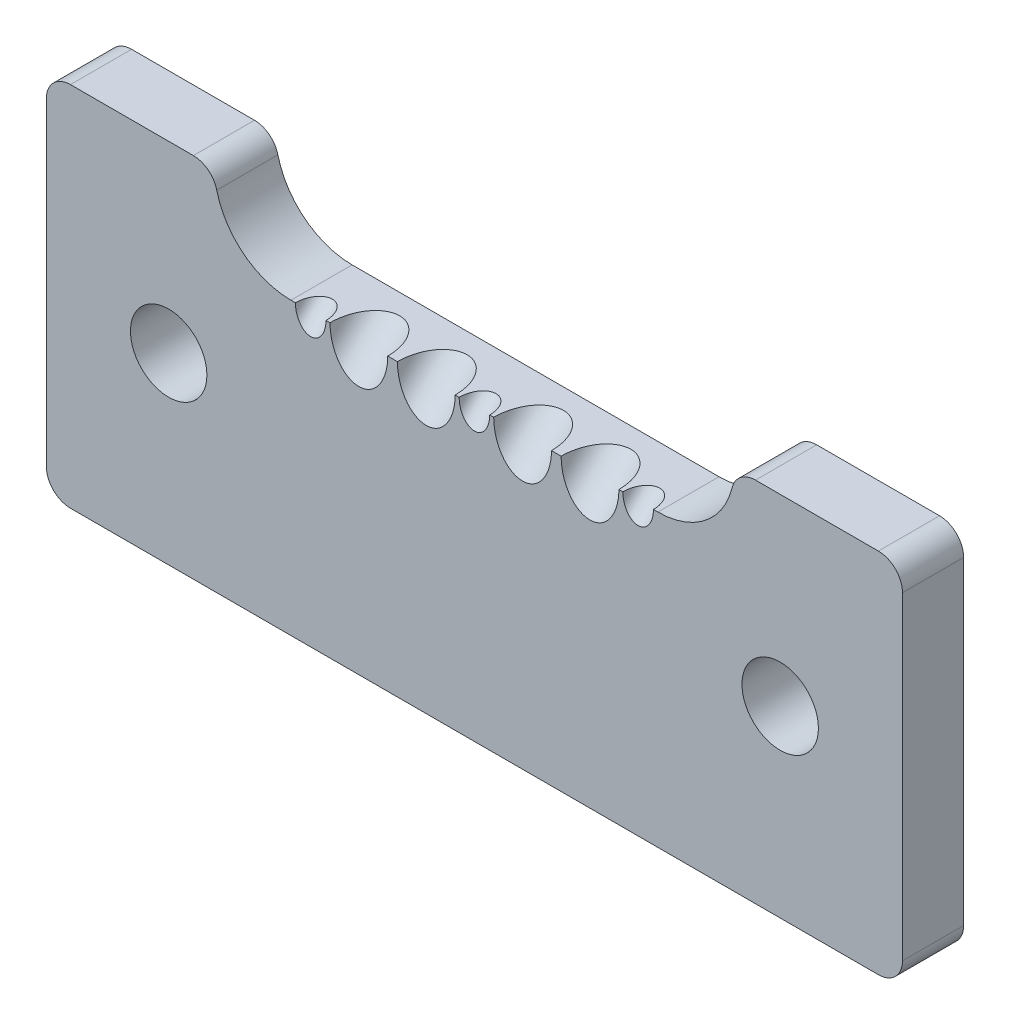
ISO-10303-21;
HEADER;
FILE_DESCRIPTION(('STEP AP214'),'2;1');
FILE_NAME('part.step','',(''),(''),'','','');
FILE_SCHEMA(('AUTOMOTIVE_DESIGN { 1 0 10303 214 1 1 1 1 }'));
ENDSEC;
DATA;
#1=APPLICATION_CONTEXT('core data for automotive mechanical design processes');
#2=APPLICATION_PROTOCOL_DEFINITION('international standard','automotive_design',2000,#1);
#3=PRODUCT_CONTEXT('',#1,'mechanical');
#4=PRODUCT('Part','Part','',(#3));
#5=PRODUCT_RELATED_PRODUCT_CATEGORY('part','',(#4));
#6=PRODUCT_DEFINITION_FORMATION('','',#4);
#7=PRODUCT_DEFINITION_CONTEXT('part definition',#1,'design');
#8=PRODUCT_DEFINITION('design','',#6,#7);
#9=PRODUCT_DEFINITION_SHAPE('','',#8);
#10=(LENGTH_UNIT() NAMED_UNIT(*) SI_UNIT(.MILLI.,.METRE.));
#11=(NAMED_UNIT(*) PLANE_ANGLE_UNIT() SI_UNIT($,.RADIAN.));
#12=(NAMED_UNIT(*) SI_UNIT($,.STERADIAN.) SOLID_ANGLE_UNIT());
#13=UNCERTAINTY_MEASURE_WITH_UNIT(LENGTH_MEASURE(1.E-05),#10,'distance_accuracy_value','');
#14=(GEOMETRIC_REPRESENTATION_CONTEXT(3) GLOBAL_UNCERTAINTY_ASSIGNED_CONTEXT((#13)) GLOBAL_UNIT_ASSIGNED_CONTEXT((#10,
#11,#12)) REPRESENTATION_CONTEXT('',''));
#15=CARTESIAN_POINT('',(0.,0.,0.));
#16=DIRECTION('',(0.,0.,1.));
#17=DIRECTION('',(1.,0.,0.));
#18=AXIS2_PLACEMENT_3D('',#15,#16,#17);
#19=CARTESIAN_POINT('',(25.4,38.1,6.35));
#20=DIRECTION('',(0.,0.,-1.));
#21=DIRECTION('',(-1.,0.,0.));
#22=AXIS2_PLACEMENT_3D('',#19,#20,#21);
#23=CYLINDRICAL_SURFACE('',#22,7.94);
#24=CARTESIAN_POINT('',(25.4,38.1,0.));
#25=DIRECTION('',(0.,0.,1.));
#26=DIRECTION('',(1.,0.,0.));
#27=AXIS2_PLACEMENT_3D('',#24,#25,#26);
#28=CIRCLE('',#27,7.94);
#29=CARTESIAN_POINT('',(17.6910115828153,36.1986590038314,0.));
#30=VERTEX_POINT('',#29);
#31=CARTESIAN_POINT('',(25.4,30.16,0.));
#32=VERTEX_POINT('',#31);
#33=EDGE_CURVE('E224',#30,#32,#28,.T.);
#34=ORIENTED_EDGE('',*,*,#33,.F.);
#35=DIRECTION('',(0.,0.,-1.));
#36=VECTOR('',#35,1.);
#37=CARTESIAN_POINT('',(17.6910115828153,36.1986590038314,6.35));
#38=LINE('',#37,#36);
#39=CARTESIAN_POINT('',(17.6910115828153,36.1986590038314,6.35));
#40=VERTEX_POINT('',#39);
#41=EDGE_CURVE('E188',#40,#30,#38,.T.);
#42=ORIENTED_EDGE('',*,*,#41,.F.);
#43=CARTESIAN_POINT('',(25.4,38.1,6.35));
#44=DIRECTION('',(0.,0.,1.));
#45=DIRECTION('',(1.,0.,0.));
#46=AXIS2_PLACEMENT_3D('',#43,#44,#45);
#47=CIRCLE('',#46,7.94);
#48=CARTESIAN_POINT('',(25.4,30.16,6.35));
#49=VERTEX_POINT('',#48);
#50=EDGE_CURVE('E331',#40,#49,#47,.T.);
#51=ORIENTED_EDGE('',*,*,#50,.T.);
#52=DIRECTION('',(0.,0.,-1.));
#53=VECTOR('',#52,1.);
#54=CARTESIAN_POINT('',(25.4,30.16,6.35));
#55=LINE('',#54,#53);
#56=EDGE_CURVE('E213',#49,#32,#55,.T.);
#57=ORIENTED_EDGE('',*,*,#56,.T.);
#58=EDGE_LOOP('',(#34,#42,#51,#57));
#59=FACE_BOUND('',#58,.T.);
#60=ADVANCED_FACE('F38',(#59),#23,.F.);
#61=CARTESIAN_POINT('',(15.2637482272785,35.6,6.35));
#62=DIRECTION('',(0.,0.,-1.));
#63=DIRECTION('',(-1.,0.,0.));
#64=AXIS2_PLACEMENT_3D('',#61,#62,#63);
#65=CYLINDRICAL_SURFACE('',#64,2.5);
#66=CARTESIAN_POINT('',(15.2637482272785,35.6,0.));
#67=DIRECTION('',(0.,0.,1.));
#68=DIRECTION('',(1.,0.,0.));
#69=AXIS2_PLACEMENT_3D('',#66,#67,#68);
#70=CIRCLE('',#69,2.5);
#71=CARTESIAN_POINT('',(15.2637482272785,38.1,0.));
#72=VERTEX_POINT('',#71);
#73=EDGE_CURVE('E227',#30,#72,#70,.T.);
#74=ORIENTED_EDGE('',*,*,#73,.T.);
#75=DIRECTION('',(0.,0.,-1.));
#76=VECTOR('',#75,1.);
#77=CARTESIAN_POINT('',(15.2637482272785,38.1,6.35));
#78=LINE('',#77,#76);
#79=CARTESIAN_POINT('',(15.2637482272785,38.1,6.35));
#80=VERTEX_POINT('',#79);
#81=EDGE_CURVE('E294',#80,#72,#78,.T.);
#82=ORIENTED_EDGE('',*,*,#81,.F.);
#83=CARTESIAN_POINT('',(15.2637482272785,35.6,6.35));
#84=DIRECTION('',(0.,0.,1.));
#85=DIRECTION('',(1.,0.,0.));
#86=AXIS2_PLACEMENT_3D('',#83,#84,#85);
#87=CIRCLE('',#86,2.5);
#88=EDGE_CURVE('E334',#40,#80,#87,.T.);
#89=ORIENTED_EDGE('',*,*,#88,.F.);
#90=ORIENTED_EDGE('',*,*,#41,.T.);
#91=EDGE_LOOP('',(#74,#82,#89,#90));
#92=FACE_BOUND('',#91,.T.);
#93=ADVANCED_FACE('F395',(#92),#65,.T.);
#94=CARTESIAN_POINT('',(0.,38.1,6.35));
#95=DIRECTION('',(0.,1.,0.));
#96=DIRECTION('',(0.,0.,1.));
#97=AXIS2_PLACEMENT_3D('',#94,#95,#96);
#98=PLANE('',#97);
#99=DIRECTION('',(1.,0.,0.));
#100=VECTOR('',#99,1.);
#101=CARTESIAN_POINT('',(0.,38.1,0.));
#102=LINE('',#101,#100);
#103=CARTESIAN_POINT('',(2.50000000000002,38.1,0.));
#104=VERTEX_POINT('',#103);
#105=EDGE_CURVE('E230',#104,#72,#102,.T.);
#106=ORIENTED_EDGE('',*,*,#105,.F.);
#107=DIRECTION('',(0.,0.,-1.));
#108=VECTOR('',#107,1.);
#109=CARTESIAN_POINT('',(2.50000000000002,38.1,6.35));
#110=LINE('',#109,#108);
#111=CARTESIAN_POINT('',(2.50000000000002,38.1,6.35));
#112=VERTEX_POINT('',#111);
#113=EDGE_CURVE('E292',#112,#104,#110,.T.);
#114=ORIENTED_EDGE('',*,*,#113,.F.);
#115=DIRECTION('',(1.,0.,0.));
#116=VECTOR('',#115,1.);
#117=CARTESIAN_POINT('',(0.,38.1,6.35));
#118=LINE('',#117,#116);
#119=EDGE_CURVE('E336',#112,#80,#118,.T.);
#120=ORIENTED_EDGE('',*,*,#119,.T.);
#121=ORIENTED_EDGE('',*,*,#81,.T.);
#122=EDGE_LOOP('',(#106,#114,#120,#121));
#123=FACE_BOUND('',#122,.T.);
#124=ADVANCED_FACE('F400',(#123),#98,.T.);
#125=CARTESIAN_POINT('',(2.5,35.6,6.35));
#126=DIRECTION('',(0.,0.,-1.));
#127=DIRECTION('',(-1.,0.,0.));
#128=AXIS2_PLACEMENT_3D('',#125,#126,#127);
#129=CYLINDRICAL_SURFACE('',#128,2.5);
#130=CARTESIAN_POINT('',(2.5,35.6,0.));
#131=DIRECTION('',(0.,0.,1.));
#132=DIRECTION('',(1.,0.,0.));
#133=AXIS2_PLACEMENT_3D('',#130,#131,#132);
#134=CIRCLE('',#133,2.5);
#135=CARTESIAN_POINT('',(0.,35.6,0.));
#136=VERTEX_POINT('',#135);
#137=EDGE_CURVE('E233',#104,#136,#134,.T.);
#138=ORIENTED_EDGE('',*,*,#137,.T.);
#139=DIRECTION('',(0.,0.,-1.));
#140=VECTOR('',#139,1.);
#141=CARTESIAN_POINT('',(0.,35.6,6.35));
#142=LINE('',#141,#140);
#143=CARTESIAN_POINT('',(0.,35.6,6.35));
#144=VERTEX_POINT('',#143);
#145=EDGE_CURVE('E290',#144,#136,#142,.T.);
#146=ORIENTED_EDGE('',*,*,#145,.F.);
#147=CARTESIAN_POINT('',(2.5,35.6,6.35));
#148=DIRECTION('',(0.,0.,1.));
#149=DIRECTION('',(1.,0.,0.));
#150=AXIS2_PLACEMENT_3D('',#147,#148,#149);
#151=CIRCLE('',#150,2.5);
#152=EDGE_CURVE('E339',#112,#144,#151,.T.);
#153=ORIENTED_EDGE('',*,*,#152,.F.);
#154=ORIENTED_EDGE('',*,*,#113,.T.);
#155=EDGE_LOOP('',(#138,#146,#153,#154));
#156=FACE_BOUND('',#155,.T.);
#157=ADVANCED_FACE('F460',(#156),#129,.T.);
#158=CARTESIAN_POINT('',(0.,0.,6.35));
#159=DIRECTION('',(-1.,0.,0.));
#160=DIRECTION('',(0.,0.,1.));
#161=AXIS2_PLACEMENT_3D('',#158,#159,#160);
#162=PLANE('',#161);
#163=DIRECTION('',(0.,1.,0.));
#164=VECTOR('',#163,1.);
#165=CARTESIAN_POINT('',(0.,0.,0.));
#166=LINE('',#165,#164);
#167=CARTESIAN_POINT('',(0.,2.50000000000002,0.));
#168=VERTEX_POINT('',#167);
#169=EDGE_CURVE('E236',#168,#136,#166,.T.);
#170=ORIENTED_EDGE('',*,*,#169,.F.);
#171=DIRECTION('',(0.,0.,-1.));
#172=VECTOR('',#171,1.);
#173=CARTESIAN_POINT('',(0.,2.50000000000002,6.35));
#174=LINE('',#173,#172);
#175=CARTESIAN_POINT('',(0.,2.50000000000002,6.35));
#176=VERTEX_POINT('',#175);
#177=EDGE_CURVE('E288',#176,#168,#174,.T.);
#178=ORIENTED_EDGE('',*,*,#177,.F.);
#179=DIRECTION('',(0.,1.,0.));
#180=VECTOR('',#179,1.);
#181=CARTESIAN_POINT('',(0.,0.,6.35));
#182=LINE('',#181,#180);
#183=EDGE_CURVE('E341',#176,#144,#182,.T.);
#184=ORIENTED_EDGE('',*,*,#183,.T.);
#185=ORIENTED_EDGE('',*,*,#145,.T.);
#186=EDGE_LOOP('',(#170,#178,#184,#185));
#187=FACE_BOUND('',#186,.T.);
#188=ADVANCED_FACE('F456',(#187),#162,.T.);
#189=CARTESIAN_POINT('',(2.5,2.5,6.35));
#190=DIRECTION('',(0.,0.,-1.));
#191=DIRECTION('',(-1.,0.,0.));
#192=AXIS2_PLACEMENT_3D('',#189,#190,#191);
#193=CYLINDRICAL_SURFACE('',#192,2.5);
#194=CARTESIAN_POINT('',(2.5,2.5,0.));
#195=DIRECTION('',(0.,0.,1.));
#196=DIRECTION('',(1.,0.,0.));
#197=AXIS2_PLACEMENT_3D('',#194,#195,#196);
#198=CIRCLE('',#197,2.5);
#199=CARTESIAN_POINT('',(2.50000000000002,0.,0.));
#200=VERTEX_POINT('',#199);
#201=EDGE_CURVE('E239',#168,#200,#198,.T.);
#202=ORIENTED_EDGE('',*,*,#201,.T.);
#203=DIRECTION('',(0.,0.,-1.));
#204=VECTOR('',#203,1.);
#205=CARTESIAN_POINT('',(2.50000000000002,0.,6.35));
#206=LINE('',#205,#204);
#207=CARTESIAN_POINT('',(2.50000000000002,0.,6.35));
#208=VERTEX_POINT('',#207);
#209=EDGE_CURVE('E285',#208,#200,#206,.T.);
#210=ORIENTED_EDGE('',*,*,#209,.F.);
#211=CARTESIAN_POINT('',(2.5,2.5,6.35));
#212=DIRECTION('',(0.,0.,1.));
#213=DIRECTION('',(1.,0.,0.));
#214=AXIS2_PLACEMENT_3D('',#211,#212,#213);
#215=CIRCLE('',#214,2.5);
#216=EDGE_CURVE('E344',#176,#208,#215,.T.);
#217=ORIENTED_EDGE('',*,*,#216,.F.);
#218=ORIENTED_EDGE('',*,*,#177,.T.);
#219=EDGE_LOOP('',(#202,#210,#217,#218));
#220=FACE_BOUND('',#219,.T.);
#221=ADVANCED_FACE('F452',(#220),#193,.T.);
#222=CARTESIAN_POINT('',(0.,0.,6.35));
#223=DIRECTION('',(0.,1.,0.));
#224=DIRECTION('',(0.,0.,1.));
#225=AXIS2_PLACEMENT_3D('',#222,#223,#224);
#226=PLANE('',#225);
#227=DIRECTION('',(1.,0.,0.));
#228=VECTOR('',#227,1.);
#229=CARTESIAN_POINT('',(0.,0.,0.));
#230=LINE('',#229,#228);
#231=CARTESIAN_POINT('',(86.4,0.,0.));
#232=VERTEX_POINT('',#231);
#233=EDGE_CURVE('E242',#200,#232,#230,.T.);
#234=ORIENTED_EDGE('',*,*,#233,.T.);
#235=DIRECTION('',(0.,0.,-1.));
#236=VECTOR('',#235,1.);
#237=CARTESIAN_POINT('',(86.4,0.,6.35));
#238=LINE('',#237,#236);
#239=CARTESIAN_POINT('',(86.4,0.,6.35));
#240=VERTEX_POINT('',#239);
#241=EDGE_CURVE('E282',#240,#232,#238,.T.);
#242=ORIENTED_EDGE('',*,*,#241,.F.);
#243=DIRECTION('',(1.,0.,0.));
#244=VECTOR('',#243,1.);
#245=CARTESIAN_POINT('',(0.,0.,6.35));
#246=LINE('',#245,#244);
#247=EDGE_CURVE('E347',#208,#240,#246,.T.);
#248=ORIENTED_EDGE('',*,*,#247,.F.);
#249=ORIENTED_EDGE('',*,*,#209,.T.);
#250=EDGE_LOOP('',(#234,#242,#248,#249));
#251=FACE_BOUND('',#250,.T.);
#252=ADVANCED_FACE('F448',(#251),#226,.F.);
#253=CARTESIAN_POINT('',(86.4,2.5,6.35));
#254=DIRECTION('',(0.,0.,-1.));
#255=DIRECTION('',(-1.,0.,0.));
#256=AXIS2_PLACEMENT_3D('',#253,#254,#255);
#257=CYLINDRICAL_SURFACE('',#256,2.5);
#258=CARTESIAN_POINT('',(86.4,2.5,0.));
#259=DIRECTION('',(0.,0.,1.));
#260=DIRECTION('',(1.,0.,0.));
#261=AXIS2_PLACEMENT_3D('',#258,#259,#260);
#262=CIRCLE('',#261,2.5);
#263=CARTESIAN_POINT('',(88.9,2.5,0.));
#264=VERTEX_POINT('',#263);
#265=EDGE_CURVE('E245',#232,#264,#262,.T.);
#266=ORIENTED_EDGE('',*,*,#265,.T.);
#267=DIRECTION('',(0.,0.,-1.));
#268=VECTOR('',#267,1.);
#269=CARTESIAN_POINT('',(88.9,2.5,6.35));
#270=LINE('',#269,#268);
#271=CARTESIAN_POINT('',(88.9,2.5,6.35));
#272=VERTEX_POINT('',#271);
#273=EDGE_CURVE('E279',#272,#264,#270,.T.);
#274=ORIENTED_EDGE('',*,*,#273,.F.);
#275=CARTESIAN_POINT('',(86.4,2.5,6.35));
#276=DIRECTION('',(0.,0.,1.));
#277=DIRECTION('',(1.,0.,0.));
#278=AXIS2_PLACEMENT_3D('',#275,#276,#277);
#279=CIRCLE('',#278,2.5);
#280=EDGE_CURVE('E350',#240,#272,#279,.T.);
#281=ORIENTED_EDGE('',*,*,#280,.F.);
#282=ORIENTED_EDGE('',*,*,#241,.T.);
#283=EDGE_LOOP('',(#266,#274,#281,#282));
#284=FACE_BOUND('',#283,.T.);
#285=ADVANCED_FACE('F444',(#284),#257,.T.);
#286=CARTESIAN_POINT('',(88.9,0.,6.35));
#287=DIRECTION('',(-1.,0.,0.));
#288=DIRECTION('',(0.,0.,1.));
#289=AXIS2_PLACEMENT_3D('',#286,#287,#288);
#290=PLANE('',#289);
#291=DIRECTION('',(0.,1.,0.));
#292=VECTOR('',#291,1.);
#293=CARTESIAN_POINT('',(88.9,0.,0.));
#294=LINE('',#293,#292);
#295=CARTESIAN_POINT('',(88.9,35.6,0.));
#296=VERTEX_POINT('',#295);
#297=EDGE_CURVE('E248',#264,#296,#294,.T.);
#298=ORIENTED_EDGE('',*,*,#297,.T.);
#299=DIRECTION('',(0.,0.,-1.));
#300=VECTOR('',#299,1.);
#301=CARTESIAN_POINT('',(88.9,35.6,6.35));
#302=LINE('',#301,#300);
#303=CARTESIAN_POINT('',(88.9,35.6,6.35));
#304=VERTEX_POINT('',#303);
#305=EDGE_CURVE('E276',#304,#296,#302,.T.);
#306=ORIENTED_EDGE('',*,*,#305,.F.);
#307=DIRECTION('',(0.,1.,0.));
#308=VECTOR('',#307,1.);
#309=CARTESIAN_POINT('',(88.9,0.,6.35));
#310=LINE('',#309,#308);
#311=EDGE_CURVE('E353',#272,#304,#310,.T.);
#312=ORIENTED_EDGE('',*,*,#311,.F.);
#313=ORIENTED_EDGE('',*,*,#273,.T.);
#314=EDGE_LOOP('',(#298,#306,#312,#313));
#315=FACE_BOUND('',#314,.T.);
#316=ADVANCED_FACE('F440',(#315),#290,.F.);
#317=CARTESIAN_POINT('',(86.4,35.6,6.35));
#318=DIRECTION('',(0.,0.,-1.));
#319=DIRECTION('',(-1.,0.,0.));
#320=AXIS2_PLACEMENT_3D('',#317,#318,#319);
#321=CYLINDRICAL_SURFACE('',#320,2.5);
#322=CARTESIAN_POINT('',(86.4,35.6,0.));
#323=DIRECTION('',(0.,0.,1.));
#324=DIRECTION('',(1.,0.,0.));
#325=AXIS2_PLACEMENT_3D('',#322,#323,#324);
#326=CIRCLE('',#325,2.5);
#327=CARTESIAN_POINT('',(86.4,38.1,0.));
#328=VERTEX_POINT('',#327);
#329=EDGE_CURVE('E251',#296,#328,#326,.T.);
#330=ORIENTED_EDGE('',*,*,#329,.T.);
#331=DIRECTION('',(0.,0.,-1.));
#332=VECTOR('',#331,1.);
#333=CARTESIAN_POINT('',(86.4,38.1,6.35));
#334=LINE('',#333,#332);
#335=CARTESIAN_POINT('',(86.4,38.1,6.35));
#336=VERTEX_POINT('',#335);
#337=EDGE_CURVE('E274',#336,#328,#334,.T.);
#338=ORIENTED_EDGE('',*,*,#337,.F.);
#339=CARTESIAN_POINT('',(86.4,35.6,6.35));
#340=DIRECTION('',(0.,0.,1.));
#341=DIRECTION('',(1.,0.,0.));
#342=AXIS2_PLACEMENT_3D('',#339,#340,#341);
#343=CIRCLE('',#342,2.5);
#344=EDGE_CURVE('E356',#304,#336,#343,.T.);
#345=ORIENTED_EDGE('',*,*,#344,.F.);
#346=ORIENTED_EDGE('',*,*,#305,.T.);
#347=EDGE_LOOP('',(#330,#338,#345,#346));
#348=FACE_BOUND('',#347,.T.);
#349=ADVANCED_FACE('F436',(#348),#321,.T.);
#350=CARTESIAN_POINT('',(0.,38.1,6.35));
#351=DIRECTION('',(0.,1.,0.));
#352=DIRECTION('',(0.,0.,1.));
#353=AXIS2_PLACEMENT_3D('',#350,#351,#352);
#354=PLANE('',#353);
#355=DIRECTION('',(1.,0.,0.));
#356=VECTOR('',#355,1.);
#357=CARTESIAN_POINT('',(0.,38.1,0.));
#358=LINE('',#357,#356);
#359=CARTESIAN_POINT('',(73.6362517727215,38.1,0.));
#360=VERTEX_POINT('',#359);
#361=EDGE_CURVE('E254',#360,#328,#358,.T.);
#362=ORIENTED_EDGE('',*,*,#361,.F.);
#363=DIRECTION('',(0.,0.,-1.));
#364=VECTOR('',#363,1.);
#365=CARTESIAN_POINT('',(73.6362517727215,38.1,6.35));
#366=LINE('',#365,#364);
#367=CARTESIAN_POINT('',(73.6362517727215,38.1,6.35));
#368=VERTEX_POINT('',#367);
#369=EDGE_CURVE('E272',#368,#360,#366,.T.);
#370=ORIENTED_EDGE('',*,*,#369,.F.);
#371=DIRECTION('',(1.,0.,0.));
#372=VECTOR('',#371,1.);
#373=CARTESIAN_POINT('',(0.,38.1,6.35));
#374=LINE('',#373,#372);
#375=EDGE_CURVE('E358',#368,#336,#374,.T.);
#376=ORIENTED_EDGE('',*,*,#375,.T.);
#377=ORIENTED_EDGE('',*,*,#337,.T.);
#378=EDGE_LOOP('',(#362,#370,#376,#377));
#379=FACE_BOUND('',#378,.T.);
#380=ADVANCED_FACE('F432',(#379),#354,.T.);
#381=CARTESIAN_POINT('',(73.6362517727215,35.6,6.35));
#382=DIRECTION('',(0.,0.,-1.));
#383=DIRECTION('',(-1.,0.,0.));
#384=AXIS2_PLACEMENT_3D('',#381,#382,#383);
#385=CYLINDRICAL_SURFACE('',#384,2.5);
#386=CARTESIAN_POINT('',(73.6362517727215,35.6,0.));
#387=DIRECTION('',(0.,0.,1.));
#388=DIRECTION('',(1.,0.,0.));
#389=AXIS2_PLACEMENT_3D('',#386,#387,#388);
#390=CIRCLE('',#389,2.5);
#391=CARTESIAN_POINT('',(71.2089884171848,36.1986590038314,0.));
#392=VERTEX_POINT('',#391);
#393=EDGE_CURVE('E257',#360,#392,#390,.T.);
#394=ORIENTED_EDGE('',*,*,#393,.T.);
#395=DIRECTION('',(0.,0.,-1.));
#396=VECTOR('',#395,1.);
#397=CARTESIAN_POINT('',(71.2089884171848,36.1986590038314,6.35));
#398=LINE('',#397,#396);
#399=CARTESIAN_POINT('',(71.2089884171848,36.1986590038314,6.35));
#400=VERTEX_POINT('',#399);
#401=EDGE_CURVE('E270',#400,#392,#398,.T.);
#402=ORIENTED_EDGE('',*,*,#401,.F.);
#403=CARTESIAN_POINT('',(73.6362517727215,35.6,6.35));
#404=DIRECTION('',(0.,0.,1.));
#405=DIRECTION('',(1.,0.,0.));
#406=AXIS2_PLACEMENT_3D('',#403,#404,#405);
#407=CIRCLE('',#406,2.5);
#408=EDGE_CURVE('E360',#368,#400,#407,.T.);
#409=ORIENTED_EDGE('',*,*,#408,.F.);
#410=ORIENTED_EDGE('',*,*,#369,.T.);
#411=EDGE_LOOP('',(#394,#402,#409,#410));
#412=FACE_BOUND('',#411,.T.);
#413=ADVANCED_FACE('F412',(#412),#385,.T.);
#414=CARTESIAN_POINT('',(63.5,38.1,6.35));
#415=DIRECTION('',(0.,0.,-1.));
#416=DIRECTION('',(-1.,0.,0.));
#417=AXIS2_PLACEMENT_3D('',#414,#415,#416);
#418=CYLINDRICAL_SURFACE('',#417,7.94);
#419=CARTESIAN_POINT('',(63.5,38.1,0.));
#420=DIRECTION('',(0.,0.,1.));
#421=DIRECTION('',(1.,0.,0.));
#422=AXIS2_PLACEMENT_3D('',#419,#420,#421);
#423=CIRCLE('',#422,7.94);
#424=CARTESIAN_POINT('',(63.5,30.16,0.));
#425=VERTEX_POINT('',#424);
#426=EDGE_CURVE('E260',#425,#392,#423,.T.);
#427=ORIENTED_EDGE('',*,*,#426,.F.);
#428=DIRECTION('',(0.,0.,-1.));
#429=VECTOR('',#428,1.);
#430=CARTESIAN_POINT('',(63.5,30.16,6.35));
#431=LINE('',#430,#429);
#432=CARTESIAN_POINT('',(63.5,30.16,6.35));
#433=VERTEX_POINT('',#432);
#434=EDGE_CURVE('E268',#433,#425,#431,.T.);
#435=ORIENTED_EDGE('',*,*,#434,.F.);
#436=CARTESIAN_POINT('',(63.5,38.1,6.35));
#437=DIRECTION('',(0.,0.,1.));
#438=DIRECTION('',(1.,0.,0.));
#439=AXIS2_PLACEMENT_3D('',#436,#437,#438);
#440=CIRCLE('',#439,7.94);
#441=EDGE_CURVE('E215',#433,#400,#440,.T.);
#442=ORIENTED_EDGE('',*,*,#441,.T.);
#443=ORIENTED_EDGE('',*,*,#401,.T.);
#444=EDGE_LOOP('',(#427,#435,#442,#443));
#445=FACE_BOUND('',#444,.T.);
#446=ADVANCED_FACE('F371',(#445),#418,.F.);
#447=CARTESIAN_POINT('',(76.2,19.05,6.35));
#448=DIRECTION('',(0.,0.,-1.));
#449=DIRECTION('',(-1.,0.,0.));
#450=AXIS2_PLACEMENT_3D('',#447,#448,#449);
#451=CYLINDRICAL_SURFACE('',#450,3.96874999999999);
#452=CARTESIAN_POINT('',(76.2,19.05,6.35));
#453=DIRECTION('',(0.,0.,1.));
#454=DIRECTION('',(1.,0.,0.));
#455=AXIS2_PLACEMENT_3D('',#452,#453,#454);
#456=CIRCLE('',#455,3.96874999999999);
#457=CARTESIAN_POINT('',(80.16875,19.05,6.35));
#458=VERTEX_POINT('',#457);
#459=EDGE_CURVE('E328',#458,#458,#456,.T.);
#460=ORIENTED_EDGE('',*,*,#459,.T.);
#461=EDGE_LOOP('',(#460));
#462=FACE_BOUND('',#461,.T.);
#463=CARTESIAN_POINT('',(76.2,19.05,0.));
#464=DIRECTION('',(0.,0.,1.));
#465=DIRECTION('',(1.,0.,0.));
#466=AXIS2_PLACEMENT_3D('',#463,#464,#465);
#467=CIRCLE('',#466,3.96874999999999);
#468=CARTESIAN_POINT('',(80.16875,19.05,0.));
#469=VERTEX_POINT('',#468);
#470=EDGE_CURVE('E220',#469,#469,#467,.T.);
#471=ORIENTED_EDGE('',*,*,#470,.F.);
#472=EDGE_LOOP('',(#471));
#473=FACE_BOUND('',#472,.T.);
#474=ADVANCED_FACE('F404',(#462,#473),#451,.F.);
#475=CARTESIAN_POINT('',(12.7,19.05,6.35));
#476=DIRECTION('',(0.,0.,-1.));
#477=DIRECTION('',(-1.,0.,0.));
#478=AXIS2_PLACEMENT_3D('',#475,#476,#477);
#479=CYLINDRICAL_SURFACE('',#478,3.96875);
#480=CARTESIAN_POINT('',(12.7,19.05,6.35));
#481=DIRECTION('',(0.,0.,1.));
#482=DIRECTION('',(1.,0.,0.));
#483=AXIS2_PLACEMENT_3D('',#480,#481,#482);
#484=CIRCLE('',#483,3.96875);
#485=CARTESIAN_POINT('',(16.66875,19.05,6.35));
#486=VERTEX_POINT('',#485);
#487=EDGE_CURVE('E266',#486,#486,#484,.T.);
#488=ORIENTED_EDGE('',*,*,#487,.T.);
#489=EDGE_LOOP('',(#488));
#490=FACE_BOUND('',#489,.T.);
#491=CARTESIAN_POINT('',(12.7,19.05,0.));
#492=DIRECTION('',(0.,0.,1.));
#493=DIRECTION('',(1.,0.,0.));
#494=AXIS2_PLACEMENT_3D('',#491,#492,#493);
#495=CIRCLE('',#494,3.96875);
#496=CARTESIAN_POINT('',(16.66875,19.05,0.));
#497=VERTEX_POINT('',#496);
#498=EDGE_CURVE('E217',#497,#497,#495,.T.);
#499=ORIENTED_EDGE('',*,*,#498,.F.);
#500=EDGE_LOOP('',(#499));
#501=FACE_BOUND('',#500,.T.);
#502=ADVANCED_FACE('F40',(#490,#501),#479,.F.);
#503=CARTESIAN_POINT('',(0.,30.16,6.35));
#504=DIRECTION('',(0.,1.,0.));
#505=DIRECTION('',(0.,0.,1.));
#506=AXIS2_PLACEMENT_3D('',#503,#504,#505);
#507=PLANE('',#506);
#508=CARTESIAN_POINT('',(39.45,30.16,6.35000000000001));
#509=DIRECTION('',(0.,1.,0.));
#510=DIRECTION('',(0.,0.,1.));
#511=AXIS2_PLACEMENT_3D('',#508,#509,#510);
#512=ELLIPSE('',#511,4.24264068711929,3.);
#513=CARTESIAN_POINT('',(42.45,30.16,6.35));
#514=VERTEX_POINT('',#513);
#515=CARTESIAN_POINT('',(36.45,30.16,6.35));
#516=VERTEX_POINT('',#515);
#517=EDGE_CURVE('E221',#514,#516,#512,.T.);
#518=ORIENTED_EDGE('',*,*,#517,.F.);
#519=DIRECTION('',(1.,0.,0.));
#520=VECTOR('',#519,1.);
#521=CARTESIAN_POINT('',(0.,30.16,6.35));
#522=LINE('',#521,#520);
#523=CARTESIAN_POINT('',(42.8625,30.16,6.35));
#524=VERTEX_POINT('',#523);
#525=EDGE_CURVE('E206',#514,#524,#522,.T.);
#526=ORIENTED_EDGE('',*,*,#525,.T.);
#527=CARTESIAN_POINT('',(44.45,30.16,6.35000000000001));
#528=DIRECTION('',(0.,1.,0.));
#529=DIRECTION('',(0.,0.,1.));
#530=AXIS2_PLACEMENT_3D('',#527,#528,#529);
#531=ELLIPSE('',#530,2.24506403026729,1.5875);
#532=CARTESIAN_POINT('',(46.0375,30.16,6.35));
#533=VERTEX_POINT('',#532);
#534=EDGE_CURVE('E197',#533,#524,#531,.T.);
#535=ORIENTED_EDGE('',*,*,#534,.F.);
#536=CARTESIAN_POINT('',(46.45,30.16,6.35));
#537=VERTEX_POINT('',#536);
#538=EDGE_CURVE('E196',#533,#537,#522,.T.);
#539=ORIENTED_EDGE('',*,*,#538,.T.);
#540=CARTESIAN_POINT('',(49.45,30.16,6.35000000000001));
#541=DIRECTION('',(0.,1.,0.));
#542=DIRECTION('',(0.,0.,1.));
#543=AXIS2_PLACEMENT_3D('',#540,#541,#542);
#544=ELLIPSE('',#543,4.24264068711929,3.);
#545=CARTESIAN_POINT('',(52.45,30.16,6.35));
#546=VERTEX_POINT('',#545);
#547=EDGE_CURVE('E182',#546,#537,#544,.T.);
#548=ORIENTED_EDGE('',*,*,#547,.F.);
#549=CARTESIAN_POINT('',(53.45,30.16,6.35));
#550=VERTEX_POINT('',#549);
#551=EDGE_CURVE('E194',#546,#550,#522,.T.);
#552=ORIENTED_EDGE('',*,*,#551,.T.);
#553=CARTESIAN_POINT('',(56.45,30.16,6.35000000000001));
#554=DIRECTION('',(0.,1.,0.));
#555=DIRECTION('',(0.,0.,1.));
#556=AXIS2_PLACEMENT_3D('',#553,#554,#555);
#557=ELLIPSE('',#556,4.24264068711929,3.);
#558=CARTESIAN_POINT('',(59.45,30.16,6.35));
#559=VERTEX_POINT('',#558);
#560=EDGE_CURVE('E59',#559,#550,#557,.T.);
#561=ORIENTED_EDGE('',*,*,#560,.F.);
#562=CARTESIAN_POINT('',(59.8625,30.16,6.35));
#563=VERTEX_POINT('',#562);
#564=EDGE_CURVE('E204',#559,#563,#522,.T.);
#565=ORIENTED_EDGE('',*,*,#564,.T.);
#566=CARTESIAN_POINT('',(61.45,30.16,6.35000000000001));
#567=DIRECTION('',(0.,1.,0.));
#568=DIRECTION('',(0.,0.,1.));
#569=AXIS2_PLACEMENT_3D('',#566,#567,#568);
#570=ELLIPSE('',#569,2.24506403026728,1.58749999999999);
#571=CARTESIAN_POINT('',(63.0375,30.16,6.35));
#572=VERTEX_POINT('',#571);
#573=EDGE_CURVE('E52',#572,#563,#570,.T.);
#574=ORIENTED_EDGE('',*,*,#573,.F.);
#575=EDGE_CURVE('E208',#572,#433,#522,.T.);
#576=ORIENTED_EDGE('',*,*,#575,.T.);
#577=ORIENTED_EDGE('',*,*,#434,.T.);
#578=DIRECTION('',(1.,0.,0.));
#579=VECTOR('',#578,1.);
#580=CARTESIAN_POINT('',(0.,30.16,0.));
#581=LINE('',#580,#579);
#582=EDGE_CURVE('E263',#32,#425,#581,.T.);
#583=ORIENTED_EDGE('',*,*,#582,.F.);
#584=ORIENTED_EDGE('',*,*,#56,.F.);
#585=CARTESIAN_POINT('',(25.8625,30.16,6.35));
#586=VERTEX_POINT('',#585);
#587=EDGE_CURVE('E209',#49,#586,#522,.T.);
#588=ORIENTED_EDGE('',*,*,#587,.T.);
#589=CARTESIAN_POINT('',(27.45,30.16,6.35000000000001));
#590=DIRECTION('',(0.,1.,0.));
#591=DIRECTION('',(0.,0.,1.));
#592=AXIS2_PLACEMENT_3D('',#589,#590,#591);
#593=ELLIPSE('',#592,2.24506403026729,1.5875);
#594=CARTESIAN_POINT('',(29.0375,30.16,6.35));
#595=VERTEX_POINT('',#594);
#596=EDGE_CURVE('E319',#595,#586,#593,.T.);
#597=ORIENTED_EDGE('',*,*,#596,.F.);
#598=CARTESIAN_POINT('',(29.45,30.16,6.35));
#599=VERTEX_POINT('',#598);
#600=EDGE_CURVE('E214',#595,#599,#522,.T.);
#601=ORIENTED_EDGE('',*,*,#600,.T.);
#602=CARTESIAN_POINT('',(32.45,30.16,6.35000000000001));
#603=DIRECTION('',(0.,1.,0.));
#604=DIRECTION('',(0.,0.,1.));
#605=AXIS2_PLACEMENT_3D('',#602,#603,#604);
#606=ELLIPSE('',#605,4.24264068711929,3.);
#607=CARTESIAN_POINT('',(35.45,30.16,6.35));
#608=VERTEX_POINT('',#607);
#609=EDGE_CURVE('E306',#608,#599,#606,.T.);
#610=ORIENTED_EDGE('',*,*,#609,.F.);
#611=EDGE_CURVE('E311',#608,#516,#522,.T.);
#612=ORIENTED_EDGE('',*,*,#611,.T.);
#613=EDGE_LOOP('',(#518,#526,#535,#539,#548,#552,#561,#565,#574,#576,#577,#583,#584,#588,#597,
#601,#610,#612));
#614=FACE_BOUND('',#613,.T.);
#615=ADVANCED_FACE('F193',(#614),#507,.T.);
#616=CARTESIAN_POINT('',(0.,0.,6.35));
#617=DIRECTION('',(0.,0.,1.));
#618=DIRECTION('',(1.,0.,0.));
#619=AXIS2_PLACEMENT_3D('',#616,#617,#618);
#620=PLANE('',#619);
#621=CARTESIAN_POINT('',(39.45,30.16,6.35));
#622=DIRECTION('',(0.,0.,1.));
#623=DIRECTION('',(0.,-1.,0.));
#624=AXIS2_PLACEMENT_3D('',#621,#622,#623);
#625=ELLIPSE('',#624,4.24264068711929,3.);
#626=EDGE_CURVE('E11',#516,#514,#625,.T.);
#627=ORIENTED_EDGE('',*,*,#626,.F.);
#628=ORIENTED_EDGE('',*,*,#611,.F.);
#629=CARTESIAN_POINT('',(32.45,30.16,6.35));
#630=DIRECTION('',(0.,0.,1.));
#631=DIRECTION('',(0.,-1.,0.));
#632=AXIS2_PLACEMENT_3D('',#629,#630,#631);
#633=ELLIPSE('',#632,4.24264068711929,3.);
#634=EDGE_CURVE('E46',#599,#608,#633,.T.);
#635=ORIENTED_EDGE('',*,*,#634,.F.);
#636=ORIENTED_EDGE('',*,*,#600,.F.);
#637=CARTESIAN_POINT('',(27.45,30.16,6.35));
#638=DIRECTION('',(0.,0.,1.));
#639=DIRECTION('',(0.,-1.,0.));
#640=AXIS2_PLACEMENT_3D('',#637,#638,#639);
#641=ELLIPSE('',#640,2.24506403026729,1.5875);
#642=EDGE_CURVE('E298',#586,#595,#641,.T.);
#643=ORIENTED_EDGE('',*,*,#642,.F.);
#644=ORIENTED_EDGE('',*,*,#587,.F.);
#645=ORIENTED_EDGE('',*,*,#50,.F.);
#646=ORIENTED_EDGE('',*,*,#88,.T.);
#647=ORIENTED_EDGE('',*,*,#119,.F.);
#648=ORIENTED_EDGE('',*,*,#152,.T.);
#649=ORIENTED_EDGE('',*,*,#183,.F.);
#650=ORIENTED_EDGE('',*,*,#216,.T.);
#651=ORIENTED_EDGE('',*,*,#247,.T.);
#652=ORIENTED_EDGE('',*,*,#280,.T.);
#653=ORIENTED_EDGE('',*,*,#311,.T.);
#654=ORIENTED_EDGE('',*,*,#344,.T.);
#655=ORIENTED_EDGE('',*,*,#375,.F.);
#656=ORIENTED_EDGE('',*,*,#408,.T.);
#657=ORIENTED_EDGE('',*,*,#441,.F.);
#658=ORIENTED_EDGE('',*,*,#575,.F.);
#659=CARTESIAN_POINT('',(61.45,30.16,6.35));
#660=DIRECTION('',(0.,0.,1.));
#661=DIRECTION('',(0.,-1.,0.));
#662=AXIS2_PLACEMENT_3D('',#659,#660,#661);
#663=ELLIPSE('',#662,2.24506403026728,1.58749999999999);
#664=EDGE_CURVE('E300',#563,#572,#663,.T.);
#665=ORIENTED_EDGE('',*,*,#664,.F.);
#666=ORIENTED_EDGE('',*,*,#564,.F.);
#667=CARTESIAN_POINT('',(56.45,30.16,6.35));
#668=DIRECTION('',(0.,0.,1.));
#669=DIRECTION('',(0.,-1.,0.));
#670=AXIS2_PLACEMENT_3D('',#667,#668,#669);
#671=ELLIPSE('',#670,4.24264068711929,3.);
#672=EDGE_CURVE('E203',#550,#559,#671,.T.);
#673=ORIENTED_EDGE('',*,*,#672,.F.);
#674=ORIENTED_EDGE('',*,*,#551,.F.);
#675=CARTESIAN_POINT('',(49.45,30.16,6.35));
#676=DIRECTION('',(0.,0.,1.));
#677=DIRECTION('',(0.,-1.,0.));
#678=AXIS2_PLACEMENT_3D('',#675,#676,#677);
#679=ELLIPSE('',#678,4.24264068711929,3.);
#680=EDGE_CURVE('E179',#537,#546,#679,.T.);
#681=ORIENTED_EDGE('',*,*,#680,.F.);
#682=ORIENTED_EDGE('',*,*,#538,.F.);
#683=CARTESIAN_POINT('',(44.45,30.16,6.35));
#684=DIRECTION('',(0.,0.,1.));
#685=DIRECTION('',(0.,-1.,0.));
#686=AXIS2_PLACEMENT_3D('',#683,#684,#685);
#687=ELLIPSE('',#686,2.24506403026729,1.5875);
#688=EDGE_CURVE('E187',#524,#533,#687,.T.);
#689=ORIENTED_EDGE('',*,*,#688,.F.);
#690=ORIENTED_EDGE('',*,*,#525,.F.);
#691=EDGE_LOOP('',(#627,#628,#635,#636,#643,#644,#645,#646,#647,#648,#649,#650,#651,#652,#653,
#654,#655,#656,#657,#658,#665,#666,#673,#674,#681,#682,#689,#690));
#692=FACE_BOUND('',#691,.T.);
#693=ORIENTED_EDGE('',*,*,#487,.F.);
#694=EDGE_LOOP('',(#693));
#695=FACE_BOUND('',#694,.T.);
#696=ORIENTED_EDGE('',*,*,#459,.F.);
#697=EDGE_LOOP('',(#696));
#698=FACE_BOUND('',#697,.T.);
#699=ADVANCED_FACE('F200',(#692,#695,#698),#620,.T.);
#700=CARTESIAN_POINT('',(0.,0.,0.));
#701=DIRECTION('',(0.,0.,1.));
#702=DIRECTION('',(1.,0.,0.));
#703=AXIS2_PLACEMENT_3D('',#700,#701,#702);
#704=PLANE('',#703);
#705=ORIENTED_EDGE('',*,*,#498,.T.);
#706=EDGE_LOOP('',(#705));
#707=FACE_BOUND('',#706,.T.);
#708=ORIENTED_EDGE('',*,*,#470,.T.);
#709=EDGE_LOOP('',(#708));
#710=FACE_BOUND('',#709,.T.);
#711=ORIENTED_EDGE('',*,*,#33,.T.);
#712=ORIENTED_EDGE('',*,*,#582,.T.);
#713=ORIENTED_EDGE('',*,*,#426,.T.);
#714=ORIENTED_EDGE('',*,*,#393,.F.);
#715=ORIENTED_EDGE('',*,*,#361,.T.);
#716=ORIENTED_EDGE('',*,*,#329,.F.);
#717=ORIENTED_EDGE('',*,*,#297,.F.);
#718=ORIENTED_EDGE('',*,*,#265,.F.);
#719=ORIENTED_EDGE('',*,*,#233,.F.);
#720=ORIENTED_EDGE('',*,*,#201,.F.);
#721=ORIENTED_EDGE('',*,*,#169,.T.);
#722=ORIENTED_EDGE('',*,*,#137,.F.);
#723=ORIENTED_EDGE('',*,*,#105,.T.);
#724=ORIENTED_EDGE('',*,*,#73,.F.);
#725=EDGE_LOOP('',(#711,#712,#713,#714,#715,#716,#717,#718,#719,#720,#721,#722,#723,#724));
#726=FACE_BOUND('',#725,.T.);
#727=ADVANCED_FACE('F374',(#707,#710,#726),#704,.F.);
#728=CARTESIAN_POINT('',(49.45,37.305,-0.795000000000002));
#729=DIRECTION('',(0.,-0.707106781186547,0.707106781186548));
#730=DIRECTION('',(0.,-0.707106781186548,-0.707106781186547));
#731=AXIS2_PLACEMENT_3D('',#728,#729,#730);
#732=CYLINDRICAL_SURFACE('',#731,3.);
#733=ORIENTED_EDGE('',*,*,#547,.T.);
#734=ORIENTED_EDGE('',*,*,#680,.T.);
#735=EDGE_LOOP('',(#733,#734));
#736=FACE_BOUND('',#735,.T.);
#737=ADVANCED_FACE('F181',(#736),#732,.F.);
#738=CARTESIAN_POINT('',(44.45,37.305,-0.795000000000002));
#739=DIRECTION('',(0.,-0.707106781186547,0.707106781186548));
#740=DIRECTION('',(0.,-0.707106781186548,-0.707106781186547));
#741=AXIS2_PLACEMENT_3D('',#738,#739,#740);
#742=CYLINDRICAL_SURFACE('',#741,1.5875);
#743=ORIENTED_EDGE('',*,*,#534,.T.);
#744=ORIENTED_EDGE('',*,*,#688,.T.);
#745=EDGE_LOOP('',(#743,#744));
#746=FACE_BOUND('',#745,.T.);
#747=ADVANCED_FACE('F318',(#746),#742,.F.);
#748=CARTESIAN_POINT('',(27.45,37.305,-0.795000000000002));
#749=DIRECTION('',(0.,-0.707106781186547,0.707106781186548));
#750=DIRECTION('',(0.,-0.707106781186548,-0.707106781186547));
#751=AXIS2_PLACEMENT_3D('',#748,#749,#750);
#752=CYLINDRICAL_SURFACE('',#751,1.5875);
#753=ORIENTED_EDGE('',*,*,#596,.T.);
#754=ORIENTED_EDGE('',*,*,#642,.T.);
#755=EDGE_LOOP('',(#753,#754));
#756=FACE_BOUND('',#755,.T.);
#757=ADVANCED_FACE('F383',(#756),#752,.F.);
#758=CARTESIAN_POINT('',(61.45,37.305,-0.795000000000002));
#759=DIRECTION('',(0.,-0.707106781186547,0.707106781186548));
#760=DIRECTION('',(0.,-0.707106781186548,-0.707106781186547));
#761=AXIS2_PLACEMENT_3D('',#758,#759,#760);
#762=CYLINDRICAL_SURFACE('',#761,1.58749999999999);
#763=ORIENTED_EDGE('',*,*,#573,.T.);
#764=ORIENTED_EDGE('',*,*,#664,.T.);
#765=EDGE_LOOP('',(#763,#764));
#766=FACE_BOUND('',#765,.T.);
#767=ADVANCED_FACE('F385',(#766),#762,.F.);
#768=CARTESIAN_POINT('',(56.45,37.305,-0.795000000000002));
#769=DIRECTION('',(0.,-0.707106781186547,0.707106781186548));
#770=DIRECTION('',(0.,-0.707106781186548,-0.707106781186547));
#771=AXIS2_PLACEMENT_3D('',#768,#769,#770);
#772=CYLINDRICAL_SURFACE('',#771,3.);
#773=ORIENTED_EDGE('',*,*,#560,.T.);
#774=ORIENTED_EDGE('',*,*,#672,.T.);
#775=EDGE_LOOP('',(#773,#774));
#776=FACE_BOUND('',#775,.T.);
#777=ADVANCED_FACE('F391',(#776),#772,.F.);
#778=CARTESIAN_POINT('',(32.45,37.305,-0.795000000000002));
#779=DIRECTION('',(0.,-0.707106781186547,0.707106781186548));
#780=DIRECTION('',(0.,-0.707106781186548,-0.707106781186547));
#781=AXIS2_PLACEMENT_3D('',#778,#779,#780);
#782=CYLINDRICAL_SURFACE('',#781,3.);
#783=ORIENTED_EDGE('',*,*,#609,.T.);
#784=ORIENTED_EDGE('',*,*,#634,.T.);
#785=EDGE_LOOP('',(#783,#784));
#786=FACE_BOUND('',#785,.T.);
#787=ADVANCED_FACE('F305',(#786),#782,.F.);
#788=CARTESIAN_POINT('',(39.45,37.305,-0.795000000000002));
#789=DIRECTION('',(0.,-0.707106781186547,0.707106781186548));
#790=DIRECTION('',(0.,-0.707106781186548,-0.707106781186547));
#791=AXIS2_PLACEMENT_3D('',#788,#789,#790);
#792=CYLINDRICAL_SURFACE('',#791,3.);
#793=ORIENTED_EDGE('',*,*,#517,.T.);
#794=ORIENTED_EDGE('',*,*,#626,.T.);
#795=EDGE_LOOP('',(#793,#794));
#796=FACE_BOUND('',#795,.T.);
#797=ADVANCED_FACE('F591',(#796),#792,.F.);
#798=CLOSED_SHELL('',(#60,#93,#124,#157,#188,#221,#252,#285,#316,#349,#380,#413,#446,#474,#502,
#615,#699,#727,#737,#747,#757,#767,#777,#787,#797));
#799=MANIFOLD_SOLID_BREP('B2',#798);
#800=ADVANCED_BREP_SHAPE_REPRESENTATION('',(#18,#799),#14);
#801=SHAPE_DEFINITION_REPRESENTATION(#9,#800);
ENDSEC;
END-ISO-10303-21;
